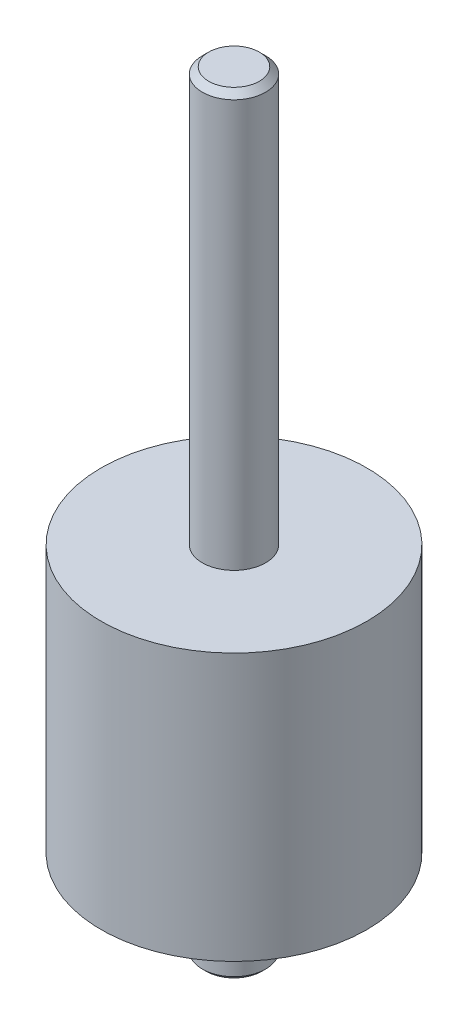
ISO-10303-21;
HEADER;
FILE_DESCRIPTION(('STEP AP214'),'2;1');
FILE_NAME('part.step','',(''),(''),'','','');
FILE_SCHEMA(('AUTOMOTIVE_DESIGN { 1 0 10303 214 1 1 1 1 }'));
ENDSEC;
DATA;
#1=APPLICATION_CONTEXT('core data for automotive mechanical design processes');
#2=APPLICATION_PROTOCOL_DEFINITION('international standard','automotive_design',2000,#1);
#3=PRODUCT_CONTEXT('',#1,'mechanical');
#4=PRODUCT('Part','Part','',(#3));
#5=PRODUCT_RELATED_PRODUCT_CATEGORY('part','',(#4));
#6=PRODUCT_DEFINITION_FORMATION('','',#4);
#7=PRODUCT_DEFINITION_CONTEXT('part definition',#1,'design');
#8=PRODUCT_DEFINITION('design','',#6,#7);
#9=PRODUCT_DEFINITION_SHAPE('','',#8);
#10=(LENGTH_UNIT() NAMED_UNIT(*) SI_UNIT(.MILLI.,.METRE.));
#11=(NAMED_UNIT(*) PLANE_ANGLE_UNIT() SI_UNIT($,.RADIAN.));
#12=(NAMED_UNIT(*) SI_UNIT($,.STERADIAN.) SOLID_ANGLE_UNIT());
#13=UNCERTAINTY_MEASURE_WITH_UNIT(LENGTH_MEASURE(1.E-05),#10,'distance_accuracy_value','');
#14=(GEOMETRIC_REPRESENTATION_CONTEXT(3) GLOBAL_UNCERTAINTY_ASSIGNED_CONTEXT((#13)) GLOBAL_UNIT_ASSIGNED_CONTEXT((#10,
#11,#12)) REPRESENTATION_CONTEXT('',''));
#15=CARTESIAN_POINT('',(0.,0.,0.));
#16=DIRECTION('',(0.,0.,1.));
#17=DIRECTION('',(1.,0.,0.));
#18=AXIS2_PLACEMENT_3D('',#15,#16,#17);
#19=CARTESIAN_POINT('',(0.,-38.6,0.));
#20=DIRECTION('',(0.,1.,0.));
#21=DIRECTION('',(-1.,0.,0.));
#22=AXIS2_PLACEMENT_3D('',#19,#20,#21);
#23=PLANE('',#22);
#24=CARTESIAN_POINT('',(0.,-38.6,0.));
#25=DIRECTION('',(0.,1.,0.));
#26=DIRECTION('',(-1.,0.,0.));
#27=AXIS2_PLACEMENT_3D('',#24,#25,#26);
#28=CIRCLE('',#27,2.2);
#29=CARTESIAN_POINT('',(-2.19999999999999,-38.6,0.));
#30=VERTEX_POINT('',#29);
#31=EDGE_CURVE('E43',#30,#30,#28,.F.);
#32=ORIENTED_EDGE('',*,*,#31,.T.);
#33=EDGE_LOOP('',(#32));
#34=FACE_BOUND('',#33,.T.);
#35=ADVANCED_FACE('F32',(#34),#23,.F.);
#36=CARTESIAN_POINT('',(0.,22.2,0.));
#37=DIRECTION('',(0.,1.,0.));
#38=DIRECTION('',(-1.,0.,0.));
#39=AXIS2_PLACEMENT_3D('',#36,#37,#38);
#40=CYLINDRICAL_SURFACE('',#39,2.5);
#41=CARTESIAN_POINT('',(0.,-38.3,0.));
#42=DIRECTION('',(0.,1.,0.));
#43=DIRECTION('',(-1.,0.,0.));
#44=AXIS2_PLACEMENT_3D('',#41,#42,#43);
#45=CIRCLE('',#44,2.5);
#46=CARTESIAN_POINT('',(-2.49999999999999,-38.3,0.));
#47=VERTEX_POINT('',#46);
#48=EDGE_CURVE('E47',#47,#47,#45,.T.);
#49=ORIENTED_EDGE('',*,*,#48,.T.);
#50=EDGE_LOOP('',(#49));
#51=FACE_BOUND('',#50,.T.);
#52=CARTESIAN_POINT('',(0.,-31.6,0.));
#53=DIRECTION('',(0.,1.,0.));
#54=DIRECTION('',(-1.,0.,0.));
#55=AXIS2_PLACEMENT_3D('',#52,#53,#54);
#56=CIRCLE('',#55,2.5);
#57=CARTESIAN_POINT('',(-2.49999999999999,-31.6,0.));
#58=VERTEX_POINT('',#57);
#59=EDGE_CURVE('E52',#58,#58,#56,.T.);
#60=ORIENTED_EDGE('',*,*,#59,.F.);
#61=EDGE_LOOP('',(#60));
#62=FACE_BOUND('',#61,.T.);
#63=ADVANCED_FACE('F82',(#51,#62),#40,.T.);
#64=CARTESIAN_POINT('',(2.50000000000001,-31.6,0.));
#65=DIRECTION('',(0.,1.,0.));
#66=DIRECTION('',(-1.,0.,0.));
#67=AXIS2_PLACEMENT_3D('',#64,#65,#66);
#68=PLANE('',#67);
#69=CARTESIAN_POINT('',(0.,-31.6,0.));
#70=DIRECTION('',(0.,1.,0.));
#71=DIRECTION('',(-1.,0.,0.));
#72=AXIS2_PLACEMENT_3D('',#69,#70,#71);
#73=CIRCLE('',#72,10.5);
#74=CARTESIAN_POINT('',(-10.5,-31.6,0.));
#75=VERTEX_POINT('',#74);
#76=EDGE_CURVE('E55',#75,#75,#73,.T.);
#77=ORIENTED_EDGE('',*,*,#76,.F.);
#78=EDGE_LOOP('',(#77));
#79=FACE_BOUND('',#78,.T.);
#80=ORIENTED_EDGE('',*,*,#59,.T.);
#81=EDGE_LOOP('',(#80));
#82=FACE_BOUND('',#81,.T.);
#83=ADVANCED_FACE('F76',(#79,#82),#68,.F.);
#84=CARTESIAN_POINT('',(0.,22.2,0.));
#85=DIRECTION('',(0.,1.,0.));
#86=DIRECTION('',(-1.,0.,0.));
#87=AXIS2_PLACEMENT_3D('',#84,#85,#86);
#88=CYLINDRICAL_SURFACE('',#87,10.5);
#89=CARTESIAN_POINT('',(0.,-10.5,0.));
#90=DIRECTION('',(0.,1.,0.));
#91=DIRECTION('',(-1.,0.,0.));
#92=AXIS2_PLACEMENT_3D('',#89,#90,#91);
#93=CIRCLE('',#92,10.5);
#94=CARTESIAN_POINT('',(-10.5,-10.5,0.));
#95=VERTEX_POINT('',#94);
#96=EDGE_CURVE('E58',#95,#95,#93,.T.);
#97=ORIENTED_EDGE('',*,*,#96,.F.);
#98=EDGE_LOOP('',(#97));
#99=FACE_BOUND('',#98,.T.);
#100=ORIENTED_EDGE('',*,*,#76,.T.);
#101=EDGE_LOOP('',(#100));
#102=FACE_BOUND('',#101,.T.);
#103=ADVANCED_FACE('F70',(#99,#102),#88,.T.);
#104=CARTESIAN_POINT('',(10.5,-10.5,0.));
#105=DIRECTION('',(0.,-1.,0.));
#106=DIRECTION('',(1.,0.,0.));
#107=AXIS2_PLACEMENT_3D('',#104,#105,#106);
#108=PLANE('',#107);
#109=CARTESIAN_POINT('',(0.,-10.5,0.));
#110=DIRECTION('',(0.,1.,0.));
#111=DIRECTION('',(-1.,0.,0.));
#112=AXIS2_PLACEMENT_3D('',#109,#110,#111);
#113=CIRCLE('',#112,2.5);
#114=CARTESIAN_POINT('',(-2.5,-10.5,0.));
#115=VERTEX_POINT('',#114);
#116=EDGE_CURVE('E61',#115,#115,#113,.T.);
#117=ORIENTED_EDGE('',*,*,#116,.F.);
#118=EDGE_LOOP('',(#117));
#119=FACE_BOUND('',#118,.T.);
#120=ORIENTED_EDGE('',*,*,#96,.T.);
#121=EDGE_LOOP('',(#120));
#122=FACE_BOUND('',#121,.T.);
#123=ADVANCED_FACE('F67',(#119,#122),#108,.F.);
#124=CARTESIAN_POINT('',(0.,22.2,0.));
#125=DIRECTION('',(0.,1.,0.));
#126=DIRECTION('',(-1.,0.,0.));
#127=AXIS2_PLACEMENT_3D('',#124,#125,#126);
#128=CYLINDRICAL_SURFACE('',#127,2.50000000000001);
#129=CARTESIAN_POINT('',(0.,21.7,0.));
#130=DIRECTION('',(0.,-1.,0.));
#131=DIRECTION('',(1.,0.,0.));
#132=AXIS2_PLACEMENT_3D('',#129,#130,#131);
#133=CIRCLE('',#132,2.50000000000001);
#134=CARTESIAN_POINT('',(2.50000000000001,21.7,0.));
#135=VERTEX_POINT('',#134);
#136=EDGE_CURVE('E10',#135,#135,#133,.T.);
#137=ORIENTED_EDGE('',*,*,#136,.T.);
#138=EDGE_LOOP('',(#137));
#139=FACE_BOUND('',#138,.T.);
#140=ORIENTED_EDGE('',*,*,#116,.T.);
#141=EDGE_LOOP('',(#140));
#142=FACE_BOUND('',#141,.T.);
#143=ADVANCED_FACE('F65',(#139,#142),#128,.T.);
#144=CARTESIAN_POINT('',(2.50000000000001,22.2,0.));
#145=DIRECTION('',(0.,-1.,0.));
#146=DIRECTION('',(1.,0.,0.));
#147=AXIS2_PLACEMENT_3D('',#144,#145,#146);
#148=PLANE('',#147);
#149=CARTESIAN_POINT('',(0.,22.2,0.));
#150=DIRECTION('',(0.,-1.,0.));
#151=DIRECTION('',(1.,0.,0.));
#152=AXIS2_PLACEMENT_3D('',#149,#150,#151);
#153=CIRCLE('',#152,2.00000000000003);
#154=CARTESIAN_POINT('',(2.00000000000003,22.2,0.));
#155=VERTEX_POINT('',#154);
#156=EDGE_CURVE('E39',#155,#155,#153,.F.);
#157=ORIENTED_EDGE('',*,*,#156,.T.);
#158=EDGE_LOOP('',(#157));
#159=FACE_BOUND('',#158,.T.);
#160=ADVANCED_FACE('F96',(#159),#148,.F.);
#161=CARTESIAN_POINT('',(0.,-38.3,0.));
#162=DIRECTION('',(0.,1.,0.));
#163=DIRECTION('',(-1.,0.,0.));
#164=AXIS2_PLACEMENT_3D('',#161,#162,#163);
#165=CONICAL_SURFACE('',#164,2.5,0.785398163397446);
#166=ORIENTED_EDGE('',*,*,#31,.F.);
#167=EDGE_LOOP('',(#166));
#168=FACE_BOUND('',#167,.T.);
#169=ORIENTED_EDGE('',*,*,#48,.F.);
#170=EDGE_LOOP('',(#169));
#171=FACE_BOUND('',#170,.T.);
#172=ADVANCED_FACE('F94',(#168,#171),#165,.T.);
#173=CARTESIAN_POINT('',(0.,22.2,0.));
#174=DIRECTION('',(0.,-1.,0.));
#175=DIRECTION('',(1.,0.,0.));
#176=AXIS2_PLACEMENT_3D('',#173,#174,#175);
#177=CONICAL_SURFACE('',#176,2.00000000000003,0.785398163397438);
#178=ORIENTED_EDGE('',*,*,#136,.F.);
#179=EDGE_LOOP('',(#178));
#180=FACE_BOUND('',#179,.T.);
#181=ORIENTED_EDGE('',*,*,#156,.F.);
#182=EDGE_LOOP('',(#181));
#183=FACE_BOUND('',#182,.T.);
#184=ADVANCED_FACE('F34',(#180,#183),#177,.T.);
#185=CLOSED_SHELL('',(#35,#63,#83,#103,#123,#143,#160,#172,#184));
#186=MANIFOLD_SOLID_BREP('B2',#185);
#187=ADVANCED_BREP_SHAPE_REPRESENTATION('',(#18,#186),#14);
#188=SHAPE_DEFINITION_REPRESENTATION(#9,#187);
ENDSEC;
END-ISO-10303-21;
